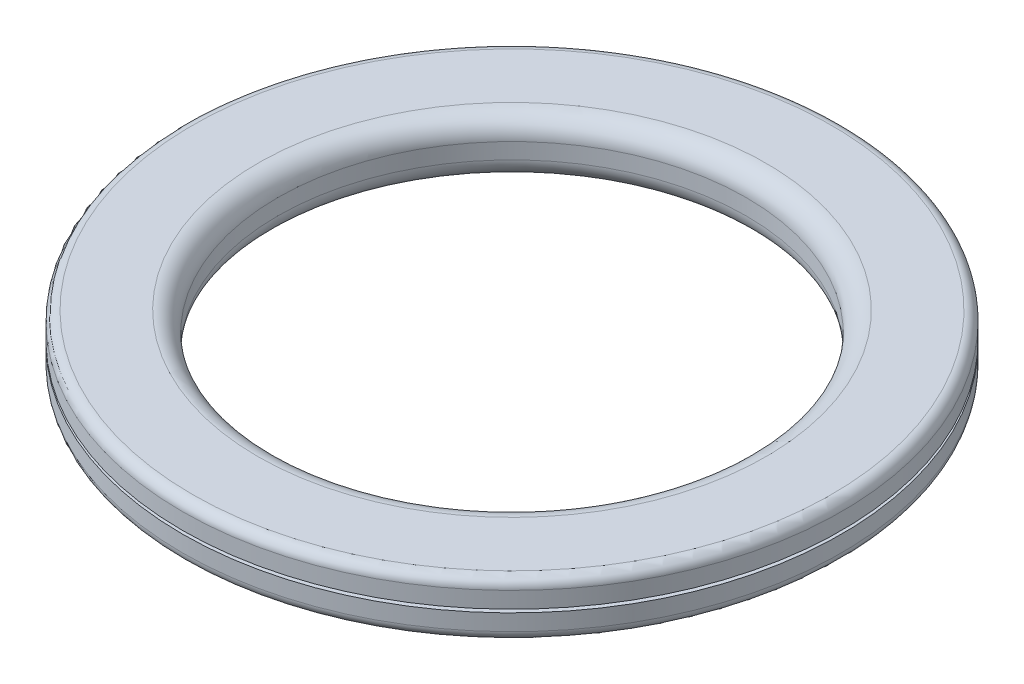
ISO-10303-21;
HEADER;
FILE_DESCRIPTION(('STEP AP214'),'2;1');
FILE_NAME('part.step','',(''),(''),'','','');
FILE_SCHEMA(('AUTOMOTIVE_DESIGN { 1 0 10303 214 1 1 1 1 }'));
ENDSEC;
DATA;
#1=APPLICATION_CONTEXT('core data for automotive mechanical design processes');
#2=APPLICATION_PROTOCOL_DEFINITION('international standard','automotive_design',2000,#1);
#3=PRODUCT_CONTEXT('',#1,'mechanical');
#4=PRODUCT('Part','Part','',(#3));
#5=PRODUCT_RELATED_PRODUCT_CATEGORY('part','',(#4));
#6=PRODUCT_DEFINITION_FORMATION('','',#4);
#7=PRODUCT_DEFINITION_CONTEXT('part definition',#1,'design');
#8=PRODUCT_DEFINITION('design','',#6,#7);
#9=PRODUCT_DEFINITION_SHAPE('','',#8);
#10=(LENGTH_UNIT() NAMED_UNIT(*) SI_UNIT(.MILLI.,.METRE.));
#11=(NAMED_UNIT(*) PLANE_ANGLE_UNIT() SI_UNIT($,.RADIAN.));
#12=(NAMED_UNIT(*) SI_UNIT($,.STERADIAN.) SOLID_ANGLE_UNIT());
#13=UNCERTAINTY_MEASURE_WITH_UNIT(LENGTH_MEASURE(1.E-05),#10,'distance_accuracy_value','');
#14=(GEOMETRIC_REPRESENTATION_CONTEXT(3) GLOBAL_UNCERTAINTY_ASSIGNED_CONTEXT((#13)) GLOBAL_UNIT_ASSIGNED_CONTEXT((#10,
#11,#12)) REPRESENTATION_CONTEXT('',''));
#15=CARTESIAN_POINT('',(0.,0.,0.));
#16=DIRECTION('',(0.,0.,1.));
#17=DIRECTION('',(1.,0.,0.));
#18=AXIS2_PLACEMENT_3D('',#15,#16,#17);
#19=CARTESIAN_POINT('',(0.,0.,0.));
#20=DIRECTION('',(0.,1.,0.));
#21=DIRECTION('',(0.,0.,1.));
#22=AXIS2_PLACEMENT_3D('',#19,#20,#21);
#23=PLANE('',#22);
#24=CARTESIAN_POINT('',(0.,0.,0.));
#25=DIRECTION('',(0.,1.,0.));
#26=DIRECTION('',(0.,0.,1.));
#27=AXIS2_PLACEMENT_3D('',#24,#25,#26);
#28=CIRCLE('',#27,6.4);
#29=CARTESIAN_POINT('',(0.,0.,6.4));
#30=VERTEX_POINT('',#29);
#31=EDGE_CURVE('E60',#30,#30,#28,.T.);
#32=ORIENTED_EDGE('',*,*,#31,.T.);
#33=EDGE_LOOP('',(#32));
#34=FACE_BOUND('',#33,.T.);
#35=CARTESIAN_POINT('',(0.,0.,0.));
#36=DIRECTION('',(0.,-1.,0.));
#37=DIRECTION('',(0.,0.,-1.));
#38=AXIS2_PLACEMENT_3D('',#35,#36,#37);
#39=CIRCLE('',#38,7.06101686591483);
#40=CARTESIAN_POINT('',(0.,0.,-7.06101686591483));
#41=VERTEX_POINT('',#40);
#42=EDGE_CURVE('E82',#41,#41,#39,.T.);
#43=ORIENTED_EDGE('',*,*,#42,.T.);
#44=EDGE_LOOP('',(#43));
#45=FACE_BOUND('',#44,.T.);
#46=ADVANCED_FACE('F31',(#34,#45),#23,.F.);
#47=CARTESIAN_POINT('',(0.,1.4,0.));
#48=DIRECTION('',(0.,-1.,0.));
#49=DIRECTION('',(0.,0.,-1.));
#50=AXIS2_PLACEMENT_3D('',#47,#48,#49);
#51=CYLINDRICAL_SURFACE('',#50,8.3);
#52=CARTESIAN_POINT('',(0.,0.25,0.));
#53=DIRECTION('',(0.,1.,0.));
#54=DIRECTION('',(0.,0.,1.));
#55=AXIS2_PLACEMENT_3D('',#52,#53,#54);
#56=CIRCLE('',#55,8.3);
#57=CARTESIAN_POINT('',(0.,0.25,8.3));
#58=VERTEX_POINT('',#57);
#59=EDGE_CURVE('E46',#58,#58,#56,.T.);
#60=ORIENTED_EDGE('',*,*,#59,.T.);
#61=EDGE_LOOP('',(#60));
#62=FACE_BOUND('',#61,.T.);
#63=CARTESIAN_POINT('',(0.,0.66,0.));
#64=DIRECTION('',(0.,1.,0.));
#65=DIRECTION('',(0.,0.,1.));
#66=AXIS2_PLACEMENT_3D('',#63,#64,#65);
#67=CIRCLE('',#66,8.3);
#68=CARTESIAN_POINT('',(0.,0.66,8.3));
#69=VERTEX_POINT('',#68);
#70=EDGE_CURVE('E63',#69,#69,#67,.T.);
#71=ORIENTED_EDGE('',*,*,#70,.F.);
#72=EDGE_LOOP('',(#71));
#73=FACE_BOUND('',#72,.T.);
#74=ADVANCED_FACE('F121',(#62,#73),#51,.T.);
#75=CARTESIAN_POINT('',(0.,1.15,0.));
#76=DIRECTION('',(0.,1.,0.));
#77=DIRECTION('',(0.,0.,1.));
#78=AXIS2_PLACEMENT_3D('',#75,#76,#77);
#79=CIRCLE('',#78,8.3);
#80=CARTESIAN_POINT('',(0.,1.15,8.3));
#81=VERTEX_POINT('',#80);
#82=EDGE_CURVE('E10',#81,#81,#79,.F.);
#83=ORIENTED_EDGE('',*,*,#82,.T.);
#84=EDGE_LOOP('',(#83));
#85=FACE_BOUND('',#84,.T.);
#86=CARTESIAN_POINT('',(0.,0.74,0.));
#87=DIRECTION('',(0.,-1.,0.));
#88=DIRECTION('',(0.,0.,-1.));
#89=AXIS2_PLACEMENT_3D('',#86,#87,#88);
#90=CIRCLE('',#89,8.3);
#91=CARTESIAN_POINT('',(0.,0.74,-8.3));
#92=VERTEX_POINT('',#91);
#93=EDGE_CURVE('E66',#92,#92,#90,.T.);
#94=ORIENTED_EDGE('',*,*,#93,.F.);
#95=EDGE_LOOP('',(#94));
#96=FACE_BOUND('',#95,.T.);
#97=ADVANCED_FACE('F117',(#85,#96),#51,.T.);
#98=CARTESIAN_POINT('',(0.,1.4,0.));
#99=DIRECTION('',(0.,1.,0.));
#100=DIRECTION('',(0.,0.,1.));
#101=AXIS2_PLACEMENT_3D('',#98,#99,#100);
#102=PLANE('',#101);
#103=CARTESIAN_POINT('',(0.,1.4,0.));
#104=DIRECTION('',(0.,1.,0.));
#105=DIRECTION('',(0.,0.,1.));
#106=AXIS2_PLACEMENT_3D('',#103,#104,#105);
#107=CIRCLE('',#106,8.05);
#108=CARTESIAN_POINT('',(0.,1.4,8.05));
#109=VERTEX_POINT('',#108);
#110=EDGE_CURVE('E38',#109,#109,#107,.T.);
#111=ORIENTED_EDGE('',*,*,#110,.T.);
#112=EDGE_LOOP('',(#111));
#113=FACE_BOUND('',#112,.T.);
#114=CARTESIAN_POINT('',(0.,1.4,0.));
#115=DIRECTION('',(0.,1.,0.));
#116=DIRECTION('',(0.,0.,1.));
#117=AXIS2_PLACEMENT_3D('',#114,#115,#116);
#118=CIRCLE('',#117,6.4);
#119=CARTESIAN_POINT('',(0.,1.4,6.4));
#120=VERTEX_POINT('',#119);
#121=EDGE_CURVE('E51',#120,#120,#118,.F.);
#122=ORIENTED_EDGE('',*,*,#121,.T.);
#123=EDGE_LOOP('',(#122));
#124=FACE_BOUND('',#123,.T.);
#125=ADVANCED_FACE('F107',(#113,#124),#102,.T.);
#126=CARTESIAN_POINT('',(0.,0.,0.));
#127=DIRECTION('',(0.,1.,0.));
#128=DIRECTION('',(0.,0.,1.));
#129=AXIS2_PLACEMENT_3D('',#126,#127,#128);
#130=CIRCLE('',#129,8.05);
#131=CARTESIAN_POINT('',(0.,0.,8.05));
#132=VERTEX_POINT('',#131);
#133=EDGE_CURVE('E42',#132,#132,#130,.F.);
#134=ORIENTED_EDGE('',*,*,#133,.T.);
#135=EDGE_LOOP('',(#134));
#136=FACE_BOUND('',#135,.T.);
#137=CARTESIAN_POINT('',(0.,0.,0.));
#138=DIRECTION('',(0.,-1.,0.));
#139=DIRECTION('',(0.,0.,-1.));
#140=AXIS2_PLACEMENT_3D('',#137,#138,#139);
#141=CIRCLE('',#140,7.14101686591483);
#142=CARTESIAN_POINT('',(0.,0.,-7.14101686591483));
#143=VERTEX_POINT('',#142);
#144=EDGE_CURVE('E76',#143,#143,#141,.T.);
#145=ORIENTED_EDGE('',*,*,#144,.F.);
#146=EDGE_LOOP('',(#145));
#147=FACE_BOUND('',#146,.T.);
#148=ADVANCED_FACE('F104',(#136,#147),#23,.F.);
#149=CARTESIAN_POINT('',(0.,1.4,0.));
#150=DIRECTION('',(0.,-1.,0.));
#151=DIRECTION('',(0.,0.,-1.));
#152=AXIS2_PLACEMENT_3D('',#149,#150,#151);
#153=CYLINDRICAL_SURFACE('',#152,5.9);
#154=CARTESIAN_POINT('',(0.,0.5,0.));
#155=DIRECTION('',(0.,1.,0.));
#156=DIRECTION('',(0.,0.,1.));
#157=AXIS2_PLACEMENT_3D('',#154,#155,#156);
#158=CIRCLE('',#157,5.9);
#159=CARTESIAN_POINT('',(0.,0.5,5.9));
#160=VERTEX_POINT('',#159);
#161=EDGE_CURVE('E54',#160,#160,#158,.F.);
#162=ORIENTED_EDGE('',*,*,#161,.T.);
#163=EDGE_LOOP('',(#162));
#164=FACE_BOUND('',#163,.T.);
#165=CARTESIAN_POINT('',(0.,0.9,0.));
#166=DIRECTION('',(0.,1.,0.));
#167=DIRECTION('',(0.,0.,1.));
#168=AXIS2_PLACEMENT_3D('',#165,#166,#167);
#169=CIRCLE('',#168,5.9);
#170=CARTESIAN_POINT('',(0.,0.9,5.9));
#171=VERTEX_POINT('',#170);
#172=EDGE_CURVE('E57',#171,#171,#169,.T.);
#173=ORIENTED_EDGE('',*,*,#172,.T.);
#174=EDGE_LOOP('',(#173));
#175=FACE_BOUND('',#174,.T.);
#176=ADVANCED_FACE('F106',(#164,#175),#153,.F.);
#177=CARTESIAN_POINT('',(7.35915325565971,0.66,0.));
#178=DIRECTION('',(0.,1.,0.));
#179=DIRECTION('',(0.,0.,1.));
#180=AXIS2_PLACEMENT_3D('',#177,#178,#179);
#181=PLANE('',#180);
#182=CARTESIAN_POINT('',(0.,0.66,0.));
#183=DIRECTION('',(0.,1.,0.));
#184=DIRECTION('',(0.,0.,1.));
#185=AXIS2_PLACEMENT_3D('',#182,#183,#184);
#186=CIRCLE('',#185,7.35915325565971);
#187=CARTESIAN_POINT('',(0.,0.66,7.35915325565971));
#188=VERTEX_POINT('',#187);
#189=EDGE_CURVE('E69',#188,#188,#186,.T.);
#190=ORIENTED_EDGE('',*,*,#189,.F.);
#191=EDGE_LOOP('',(#190));
#192=FACE_BOUND('',#191,.T.);
#193=ORIENTED_EDGE('',*,*,#70,.T.);
#194=EDGE_LOOP('',(#193));
#195=FACE_BOUND('',#194,.T.);
#196=ADVANCED_FACE('F114',(#192,#195),#181,.T.);
#197=CARTESIAN_POINT('',(8.65422762300503,0.74,0.));
#198=DIRECTION('',(0.,-1.,0.));
#199=DIRECTION('',(0.,0.,-1.));
#200=AXIS2_PLACEMENT_3D('',#197,#198,#199);
#201=PLANE('',#200);
#202=CARTESIAN_POINT('',(0.,0.74,0.));
#203=DIRECTION('',(0.,1.,0.));
#204=DIRECTION('',(0.,0.,1.));
#205=AXIS2_PLACEMENT_3D('',#202,#203,#204);
#206=CIRCLE('',#205,7.35915325565971);
#207=CARTESIAN_POINT('',(0.,0.74,7.35915325565971));
#208=VERTEX_POINT('',#207);
#209=EDGE_CURVE('E72',#208,#208,#206,.T.);
#210=ORIENTED_EDGE('',*,*,#209,.T.);
#211=EDGE_LOOP('',(#210));
#212=FACE_BOUND('',#211,.T.);
#213=ORIENTED_EDGE('',*,*,#93,.T.);
#214=EDGE_LOOP('',(#213));
#215=FACE_BOUND('',#214,.T.);
#216=ADVANCED_FACE('F140',(#212,#215),#201,.T.);
#217=CARTESIAN_POINT('',(0.,1.4,0.));
#218=DIRECTION('',(0.,1.,0.));
#219=DIRECTION('',(0.,0.,1.));
#220=AXIS2_PLACEMENT_3D('',#217,#218,#219);
#221=CYLINDRICAL_SURFACE('',#220,7.35915325565971);
#222=ORIENTED_EDGE('',*,*,#189,.T.);
#223=EDGE_LOOP('',(#222));
#224=FACE_BOUND('',#223,.T.);
#225=ORIENTED_EDGE('',*,*,#209,.F.);
#226=EDGE_LOOP('',(#225));
#227=FACE_BOUND('',#226,.T.);
#228=ADVANCED_FACE('F100',(#224,#227),#221,.T.);
#229=CARTESIAN_POINT('',(0.,0.3,0.));
#230=DIRECTION('',(0.,-1.,0.));
#231=DIRECTION('',(0.,0.,-1.));
#232=AXIS2_PLACEMENT_3D('',#229,#230,#231);
#233=CYLINDRICAL_SURFACE('',#232,7.14101686591483);
#234=CARTESIAN_POINT('',(0.,0.3,0.));
#235=DIRECTION('',(0.,-1.,0.));
#236=DIRECTION('',(0.,0.,-1.));
#237=AXIS2_PLACEMENT_3D('',#234,#235,#236);
#238=CIRCLE('',#237,7.14101686591483);
#239=CARTESIAN_POINT('',(0.,0.3,-7.14101686591483));
#240=VERTEX_POINT('',#239);
#241=EDGE_CURVE('E75',#240,#240,#238,.T.);
#242=ORIENTED_EDGE('',*,*,#241,.F.);
#243=EDGE_LOOP('',(#242));
#244=FACE_BOUND('',#243,.T.);
#245=ORIENTED_EDGE('',*,*,#144,.T.);
#246=EDGE_LOOP('',(#245));
#247=FACE_BOUND('',#246,.T.);
#248=ADVANCED_FACE('F94',(#244,#247),#233,.F.);
#249=CARTESIAN_POINT('',(0.,0.3,0.));
#250=DIRECTION('',(0.,-1.,0.));
#251=DIRECTION('',(0.,0.,-1.));
#252=AXIS2_PLACEMENT_3D('',#249,#250,#251);
#253=PLANE('',#252);
#254=CARTESIAN_POINT('',(0.,0.3,0.));
#255=DIRECTION('',(0.,-1.,0.));
#256=DIRECTION('',(0.,0.,-1.));
#257=AXIS2_PLACEMENT_3D('',#254,#255,#256);
#258=CIRCLE('',#257,7.06101686591483);
#259=CARTESIAN_POINT('',(0.,0.3,-7.06101686591483));
#260=VERTEX_POINT('',#259);
#261=EDGE_CURVE('E79',#260,#260,#258,.T.);
#262=ORIENTED_EDGE('',*,*,#261,.F.);
#263=EDGE_LOOP('',(#262));
#264=FACE_BOUND('',#263,.T.);
#265=ORIENTED_EDGE('',*,*,#241,.T.);
#266=EDGE_LOOP('',(#265));
#267=FACE_BOUND('',#266,.T.);
#268=ADVANCED_FACE('F91',(#264,#267),#253,.T.);
#269=CARTESIAN_POINT('',(0.,0.3,0.));
#270=DIRECTION('',(0.,-1.,0.));
#271=DIRECTION('',(0.,0.,-1.));
#272=AXIS2_PLACEMENT_3D('',#269,#270,#271);
#273=CYLINDRICAL_SURFACE('',#272,7.06101686591483);
#274=ORIENTED_EDGE('',*,*,#261,.T.);
#275=EDGE_LOOP('',(#274));
#276=FACE_BOUND('',#275,.T.);
#277=ORIENTED_EDGE('',*,*,#42,.F.);
#278=EDGE_LOOP('',(#277));
#279=FACE_BOUND('',#278,.T.);
#280=ADVANCED_FACE('F88',(#276,#279),#273,.T.);
#281=CARTESIAN_POINT('',(0.,0.5,0.));
#282=DIRECTION('',(0.,1.,0.));
#283=DIRECTION('',(0.,0.,1.));
#284=AXIS2_PLACEMENT_3D('',#281,#282,#283);
#285=TOROIDAL_SURFACE('',#284,6.4,0.5);
#286=ORIENTED_EDGE('',*,*,#161,.F.);
#287=EDGE_LOOP('',(#286));
#288=FACE_BOUND('',#287,.T.);
#289=ORIENTED_EDGE('',*,*,#31,.F.);
#290=EDGE_LOOP('',(#289));
#291=FACE_BOUND('',#290,.T.);
#292=ADVANCED_FACE('F131',(#288,#291),#285,.T.);
#293=CARTESIAN_POINT('',(0.,0.9,0.));
#294=DIRECTION('',(0.,1.,0.));
#295=DIRECTION('',(0.,0.,1.));
#296=AXIS2_PLACEMENT_3D('',#293,#294,#295);
#297=TOROIDAL_SURFACE('',#296,6.4,0.5);
#298=ORIENTED_EDGE('',*,*,#121,.F.);
#299=EDGE_LOOP('',(#298));
#300=FACE_BOUND('',#299,.T.);
#301=ORIENTED_EDGE('',*,*,#172,.F.);
#302=EDGE_LOOP('',(#301));
#303=FACE_BOUND('',#302,.T.);
#304=ADVANCED_FACE('F136',(#300,#303),#297,.T.);
#305=CARTESIAN_POINT('',(0.,0.25,0.));
#306=DIRECTION('',(0.,1.,0.));
#307=DIRECTION('',(0.,0.,1.));
#308=AXIS2_PLACEMENT_3D('',#305,#306,#307);
#309=TOROIDAL_SURFACE('',#308,8.05,0.25);
#310=ORIENTED_EDGE('',*,*,#133,.F.);
#311=EDGE_LOOP('',(#310));
#312=FACE_BOUND('',#311,.T.);
#313=ORIENTED_EDGE('',*,*,#59,.F.);
#314=EDGE_LOOP('',(#313));
#315=FACE_BOUND('',#314,.T.);
#316=ADVANCED_FACE('F165',(#312,#315),#309,.T.);
#317=CARTESIAN_POINT('',(0.,1.15,0.));
#318=DIRECTION('',(0.,1.,0.));
#319=DIRECTION('',(0.,0.,1.));
#320=AXIS2_PLACEMENT_3D('',#317,#318,#319);
#321=TOROIDAL_SURFACE('',#320,8.05,0.25);
#322=ORIENTED_EDGE('',*,*,#82,.F.);
#323=EDGE_LOOP('',(#322));
#324=FACE_BOUND('',#323,.T.);
#325=ORIENTED_EDGE('',*,*,#110,.F.);
#326=EDGE_LOOP('',(#325));
#327=FACE_BOUND('',#326,.T.);
#328=ADVANCED_FACE('F33',(#324,#327),#321,.T.);
#329=CLOSED_SHELL('',(#46,#74,#97,#125,#148,#176,#196,#216,#228,#248,#268,#280,#292,#304,#316,#328));
#330=MANIFOLD_SOLID_BREP('B2',#329);
#331=ADVANCED_BREP_SHAPE_REPRESENTATION('',(#18,#330),#14);
#332=SHAPE_DEFINITION_REPRESENTATION(#9,#331);
ENDSEC;
END-ISO-10303-21;
